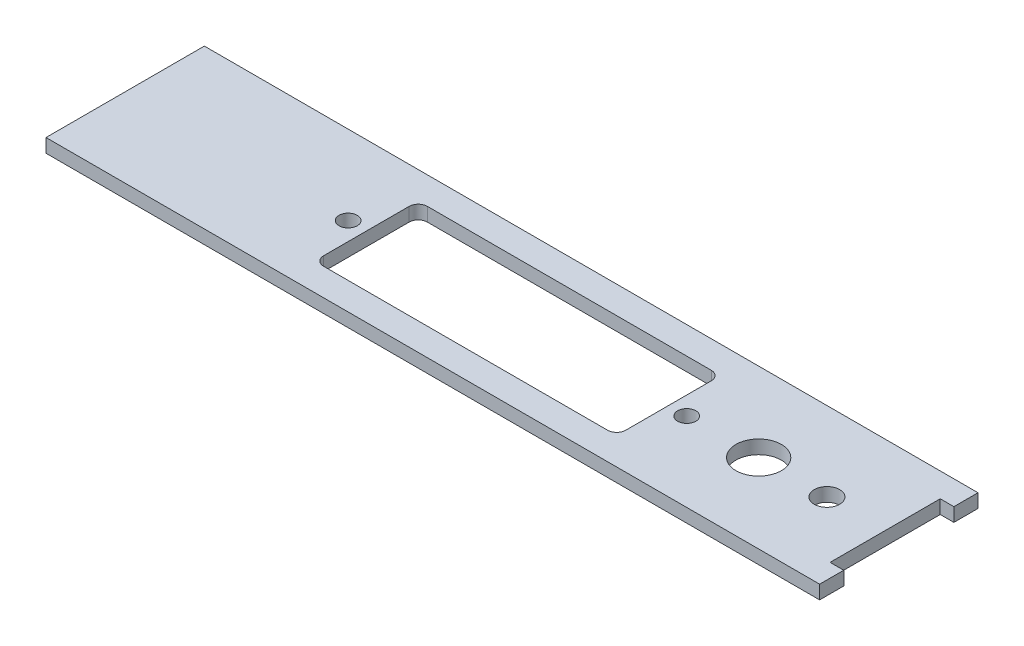
ISO-10303-21;
HEADER;
FILE_DESCRIPTION(('STEP AP214'),'2;1');
FILE_NAME('part.step','',(''),(''),'','','');
FILE_SCHEMA(('AUTOMOTIVE_DESIGN { 1 0 10303 214 1 1 1 1 }'));
ENDSEC;
DATA;
#1=APPLICATION_CONTEXT('core data for automotive mechanical design processes');
#2=APPLICATION_PROTOCOL_DEFINITION('international standard','automotive_design',2000,#1);
#3=PRODUCT_CONTEXT('',#1,'mechanical');
#4=PRODUCT('Part','Part','',(#3));
#5=PRODUCT_RELATED_PRODUCT_CATEGORY('part','',(#4));
#6=PRODUCT_DEFINITION_FORMATION('','',#4);
#7=PRODUCT_DEFINITION_CONTEXT('part definition',#1,'design');
#8=PRODUCT_DEFINITION('design','',#6,#7);
#9=PRODUCT_DEFINITION_SHAPE('','',#8);
#10=(LENGTH_UNIT() NAMED_UNIT(*) SI_UNIT(.MILLI.,.METRE.));
#11=(NAMED_UNIT(*) PLANE_ANGLE_UNIT() SI_UNIT($,.RADIAN.));
#12=(NAMED_UNIT(*) SI_UNIT($,.STERADIAN.) SOLID_ANGLE_UNIT());
#13=UNCERTAINTY_MEASURE_WITH_UNIT(LENGTH_MEASURE(1.E-05),#10,'distance_accuracy_value','');
#14=(GEOMETRIC_REPRESENTATION_CONTEXT(3) GLOBAL_UNCERTAINTY_ASSIGNED_CONTEXT((#13)) GLOBAL_UNIT_ASSIGNED_CONTEXT((#10,
#11,#12)) REPRESENTATION_CONTEXT('',''));
#15=CARTESIAN_POINT('',(0.,0.,0.));
#16=DIRECTION('',(0.,0.,1.));
#17=DIRECTION('',(1.,0.,0.));
#18=AXIS2_PLACEMENT_3D('',#15,#16,#17);
#19=CARTESIAN_POINT('',(0.,15.,0.));
#20=DIRECTION('',(0.,1.,0.));
#21=DIRECTION('',(0.,0.,1.));
#22=AXIS2_PLACEMENT_3D('',#19,#20,#21);
#23=PLANE('',#22);
#24=CARTESIAN_POINT('',(340.,15.,-4.16333634234434E-13));
#25=DIRECTION('',(0.,1.,0.));
#26=DIRECTION('',(0.,0.,1.));
#27=AXIS2_PLACEMENT_3D('',#24,#25,#26);
#28=CIRCLE('',#27,14.);
#29=CARTESIAN_POINT('',(340.,15.,13.9999999999996));
#30=VERTEX_POINT('',#29);
#31=EDGE_CURVE('E186',#30,#30,#28,.F.);
#32=ORIENTED_EDGE('',*,*,#31,.T.);
#33=EDGE_LOOP('',(#32));
#34=FACE_BOUND('',#33,.T.);
#35=CARTESIAN_POINT('',(186.,15.,0.));
#36=DIRECTION('',(0.,-1.,0.));
#37=DIRECTION('',(0.,0.,-1.));
#38=AXIS2_PLACEMENT_3D('',#35,#36,#37);
#39=CIRCLE('',#38,10.);
#40=CARTESIAN_POINT('',(186.,15.,-10.));
#41=VERTEX_POINT('',#40);
#42=EDGE_CURVE('E189',#41,#41,#39,.T.);
#43=ORIENTED_EDGE('',*,*,#42,.T.);
#44=EDGE_LOOP('',(#43));
#45=FACE_BOUND('',#44,.T.);
#46=CARTESIAN_POINT('',(-186.,15.,-4.16333634234434E-13));
#47=DIRECTION('',(0.,-1.,0.));
#48=DIRECTION('',(0.,0.,-1.));
#49=AXIS2_PLACEMENT_3D('',#46,#47,#48);
#50=CIRCLE('',#49,10.);
#51=CARTESIAN_POINT('',(-186.,15.,-10.0000000000004));
#52=VERTEX_POINT('',#51);
#53=EDGE_CURVE('E192',#52,#52,#50,.T.);
#54=ORIENTED_EDGE('',*,*,#53,.T.);
#55=EDGE_LOOP('',(#54));
#56=FACE_BOUND('',#55,.T.);
#57=CARTESIAN_POINT('',(156.,15.,47.));
#58=DIRECTION('',(0.,1.,0.));
#59=DIRECTION('',(0.,0.,1.));
#60=AXIS2_PLACEMENT_3D('',#57,#58,#59);
#61=CIRCLE('',#60,10.);
#62=CARTESIAN_POINT('',(166.,15.,47.));
#63=VERTEX_POINT('',#62);
#64=CARTESIAN_POINT('',(156.,15.,57.));
#65=VERTEX_POINT('',#64);
#66=EDGE_CURVE('E160',#63,#65,#61,.F.);
#67=ORIENTED_EDGE('',*,*,#66,.T.);
#68=DIRECTION('',(-1.,0.,0.));
#69=VECTOR('',#68,1.);
#70=CARTESIAN_POINT('',(166.,15.,57.));
#71=LINE('',#70,#69);
#72=CARTESIAN_POINT('',(-156.,15.,57.));
#73=VERTEX_POINT('',#72);
#74=EDGE_CURVE('E158',#73,#65,#71,.F.);
#75=ORIENTED_EDGE('',*,*,#74,.F.);
#76=CARTESIAN_POINT('',(-156.,15.,47.));
#77=DIRECTION('',(0.,1.,0.));
#78=DIRECTION('',(0.,0.,1.));
#79=AXIS2_PLACEMENT_3D('',#76,#77,#78);
#80=CIRCLE('',#79,10.);
#81=CARTESIAN_POINT('',(-166.,15.,47.));
#82=VERTEX_POINT('',#81);
#83=EDGE_CURVE('E157',#73,#82,#80,.F.);
#84=ORIENTED_EDGE('',*,*,#83,.T.);
#85=DIRECTION('',(0.,0.,-1.));
#86=VECTOR('',#85,1.);
#87=CARTESIAN_POINT('',(-166.,15.,57.));
#88=LINE('',#87,#86);
#89=CARTESIAN_POINT('',(-166.,15.,-47.));
#90=VERTEX_POINT('',#89);
#91=EDGE_CURVE('E154',#90,#82,#88,.F.);
#92=ORIENTED_EDGE('',*,*,#91,.F.);
#93=CARTESIAN_POINT('',(-156.,15.,-47.0000000000001));
#94=DIRECTION('',(0.,1.,0.));
#95=DIRECTION('',(0.,0.,1.));
#96=AXIS2_PLACEMENT_3D('',#93,#94,#95);
#97=CIRCLE('',#96,10.);
#98=CARTESIAN_POINT('',(-156.,15.,-57.));
#99=VERTEX_POINT('',#98);
#100=EDGE_CURVE('E151',#90,#99,#97,.F.);
#101=ORIENTED_EDGE('',*,*,#100,.T.);
#102=DIRECTION('',(1.,0.,0.));
#103=VECTOR('',#102,1.);
#104=CARTESIAN_POINT('',(-166.,15.,-57.));
#105=LINE('',#104,#103);
#106=CARTESIAN_POINT('',(156.,15.,-57.0000000000002));
#107=VERTEX_POINT('',#106);
#108=EDGE_CURVE('E148',#107,#99,#105,.F.);
#109=ORIENTED_EDGE('',*,*,#108,.F.);
#110=CARTESIAN_POINT('',(156.,15.,-47.0000000000002));
#111=DIRECTION('',(0.,1.,0.));
#112=DIRECTION('',(0.,0.,1.));
#113=AXIS2_PLACEMENT_3D('',#110,#111,#112);
#114=CIRCLE('',#113,10.);
#115=CARTESIAN_POINT('',(166.,15.,-47.0000000000002));
#116=VERTEX_POINT('',#115);
#117=EDGE_CURVE('E195',#107,#116,#114,.F.);
#118=ORIENTED_EDGE('',*,*,#117,.T.);
#119=DIRECTION('',(0.,0.,1.));
#120=VECTOR('',#119,1.);
#121=CARTESIAN_POINT('',(166.,15.,-57.0000000000002));
#122=LINE('',#121,#120);
#123=EDGE_CURVE('E85',#63,#116,#122,.F.);
#124=ORIENTED_EDGE('',*,*,#123,.F.);
#125=EDGE_LOOP('',(#67,#75,#84,#92,#101,#109,#118,#124));
#126=FACE_BOUND('',#125,.T.);
#127=CARTESIAN_POINT('',(265.,15.,0.));
#128=DIRECTION('',(0.,1.,0.));
#129=DIRECTION('',(0.,0.,1.));
#130=AXIS2_PLACEMENT_3D('',#127,#128,#129);
#131=CIRCLE('',#130,25.);
#132=CARTESIAN_POINT('',(265.,15.,25.));
#133=VERTEX_POINT('',#132);
#134=EDGE_CURVE('E19',#133,#133,#131,.F.);
#135=ORIENTED_EDGE('',*,*,#134,.T.);
#136=EDGE_LOOP('',(#135));
#137=FACE_BOUND('',#136,.T.);
#138=DIRECTION('',(-1.,0.,0.));
#139=VECTOR('',#138,1.);
#140=CARTESIAN_POINT('',(419.,15.,-87.));
#141=LINE('',#140,#139);
#142=CARTESIAN_POINT('',(-431.,15.,-87.0000000000004));
#143=VERTEX_POINT('',#142);
#144=CARTESIAN_POINT('',(419.,15.,-87.));
#145=VERTEX_POINT('',#144);
#146=EDGE_CURVE('E95',#143,#145,#141,.F.);
#147=ORIENTED_EDGE('',*,*,#146,.F.);
#148=DIRECTION('',(0.,0.,1.));
#149=VECTOR('',#148,1.);
#150=CARTESIAN_POINT('',(-431.,15.,-87.0000000000004));
#151=LINE('',#150,#149);
#152=CARTESIAN_POINT('',(-431.,15.,86.9999999999999));
#153=VERTEX_POINT('',#152);
#154=EDGE_CURVE('E135',#153,#143,#151,.F.);
#155=ORIENTED_EDGE('',*,*,#154,.F.);
#156=DIRECTION('',(1.,0.,0.));
#157=VECTOR('',#156,1.);
#158=CARTESIAN_POINT('',(-431.,15.,86.9999999999999));
#159=LINE('',#158,#157);
#160=CARTESIAN_POINT('',(419.,15.,87.));
#161=VERTEX_POINT('',#160);
#162=EDGE_CURVE('E126',#161,#153,#159,.F.);
#163=ORIENTED_EDGE('',*,*,#162,.F.);
#164=DIRECTION('',(0.,0.,-1.));
#165=VECTOR('',#164,1.);
#166=CARTESIAN_POINT('',(419.,15.,87.));
#167=LINE('',#166,#165);
#168=CARTESIAN_POINT('',(419.,15.,60.4999999999994));
#169=VERTEX_POINT('',#168);
#170=EDGE_CURVE('E120',#169,#161,#167,.F.);
#171=ORIENTED_EDGE('',*,*,#170,.F.);
#172=DIRECTION('',(-1.,0.,0.));
#173=VECTOR('',#172,1.);
#174=CARTESIAN_POINT('',(419.,15.,60.4999999999994));
#175=LINE('',#174,#173);
#176=CARTESIAN_POINT('',(404.,15.,60.5000000000001));
#177=VERTEX_POINT('',#176);
#178=EDGE_CURVE('E233',#177,#169,#175,.F.);
#179=ORIENTED_EDGE('',*,*,#178,.F.);
#180=DIRECTION('',(0.,0.,-1.));
#181=VECTOR('',#180,1.);
#182=CARTESIAN_POINT('',(404.,15.,60.5000000000001));
#183=LINE('',#182,#181);
#184=CARTESIAN_POINT('',(404.,15.,-60.5000000000002));
#185=VERTEX_POINT('',#184);
#186=EDGE_CURVE('E228',#185,#177,#183,.F.);
#187=ORIENTED_EDGE('',*,*,#186,.F.);
#188=DIRECTION('',(1.,0.,0.));
#189=VECTOR('',#188,1.);
#190=CARTESIAN_POINT('',(404.,15.,-60.5000000000002));
#191=LINE('',#190,#189);
#192=CARTESIAN_POINT('',(419.,15.,-60.5000000000002));
#193=VERTEX_POINT('',#192);
#194=EDGE_CURVE('E223',#193,#185,#191,.F.);
#195=ORIENTED_EDGE('',*,*,#194,.F.);
#196=DIRECTION('',(0.,0.,-1.));
#197=VECTOR('',#196,1.);
#198=CARTESIAN_POINT('',(419.,15.,-60.5000000000002));
#199=LINE('',#198,#197);
#200=EDGE_CURVE('E218',#145,#193,#199,.F.);
#201=ORIENTED_EDGE('',*,*,#200,.F.);
#202=EDGE_LOOP('',(#147,#155,#163,#171,#179,#187,#195,#201));
#203=FACE_BOUND('',#202,.T.);
#204=ADVANCED_FACE('F16',(#34,#45,#56,#126,#137,#203),#23,.T.);
#205=CARTESIAN_POINT('',(-431.,0.,-87.0000000000004));
#206=DIRECTION('',(-1.,0.,0.));
#207=DIRECTION('',(0.,0.,1.));
#208=AXIS2_PLACEMENT_3D('',#205,#206,#207);
#209=PLANE('',#208);
#210=DIRECTION('',(0.,1.,0.));
#211=VECTOR('',#210,1.);
#212=CARTESIAN_POINT('',(-431.,0.,-87.0000000000004));
#213=LINE('',#212,#211);
#214=CARTESIAN_POINT('',(-431.,0.,-87.0000000000004));
#215=VERTEX_POINT('',#214);
#216=EDGE_CURVE('E213',#215,#143,#213,.T.);
#217=ORIENTED_EDGE('',*,*,#216,.F.);
#218=DIRECTION('',(0.,0.,1.));
#219=VECTOR('',#218,1.);
#220=CARTESIAN_POINT('',(-431.,0.,-4.16333634234434E-13));
#221=LINE('',#220,#219);
#222=CARTESIAN_POINT('',(-431.,0.,86.9999999999999));
#223=VERTEX_POINT('',#222);
#224=EDGE_CURVE('E143',#215,#223,#221,.T.);
#225=ORIENTED_EDGE('',*,*,#224,.T.);
#226=DIRECTION('',(0.,1.,0.));
#227=VECTOR('',#226,1.);
#228=CARTESIAN_POINT('',(-431.,0.,86.9999999999999));
#229=LINE('',#228,#227);
#230=EDGE_CURVE('E131',#153,#223,#229,.F.);
#231=ORIENTED_EDGE('',*,*,#230,.F.);
#232=ORIENTED_EDGE('',*,*,#154,.T.);
#233=EDGE_LOOP('',(#217,#225,#231,#232));
#234=FACE_BOUND('',#233,.T.);
#235=ADVANCED_FACE('F141',(#234),#209,.T.);
#236=CARTESIAN_POINT('',(-431.,0.,86.9999999999999));
#237=DIRECTION('',(0.,0.,1.));
#238=DIRECTION('',(1.,0.,0.));
#239=AXIS2_PLACEMENT_3D('',#236,#237,#238);
#240=PLANE('',#239);
#241=ORIENTED_EDGE('',*,*,#230,.T.);
#242=DIRECTION('',(1.,0.,0.));
#243=VECTOR('',#242,1.);
#244=CARTESIAN_POINT('',(0.,0.,86.9999999999999));
#245=LINE('',#244,#243);
#246=CARTESIAN_POINT('',(419.,0.,87.));
#247=VERTEX_POINT('',#246);
#248=EDGE_CURVE('E245',#223,#247,#245,.T.);
#249=ORIENTED_EDGE('',*,*,#248,.T.);
#250=DIRECTION('',(0.,1.,0.));
#251=VECTOR('',#250,1.);
#252=CARTESIAN_POINT('',(419.,0.,87.));
#253=LINE('',#252,#251);
#254=EDGE_CURVE('E133',#161,#247,#253,.F.);
#255=ORIENTED_EDGE('',*,*,#254,.F.);
#256=ORIENTED_EDGE('',*,*,#162,.T.);
#257=EDGE_LOOP('',(#241,#249,#255,#256));
#258=FACE_BOUND('',#257,.T.);
#259=ADVANCED_FACE('F128',(#258),#240,.T.);
#260=CARTESIAN_POINT('',(419.,0.,87.));
#261=DIRECTION('',(1.,0.,0.));
#262=DIRECTION('',(0.,0.,-1.));
#263=AXIS2_PLACEMENT_3D('',#260,#261,#262);
#264=PLANE('',#263);
#265=ORIENTED_EDGE('',*,*,#254,.T.);
#266=DIRECTION('',(0.,0.,1.));
#267=VECTOR('',#266,1.);
#268=CARTESIAN_POINT('',(419.,0.,0.));
#269=LINE('',#268,#267);
#270=CARTESIAN_POINT('',(419.,0.,60.4999999999994));
#271=VERTEX_POINT('',#270);
#272=EDGE_CURVE('E239',#247,#271,#269,.F.);
#273=ORIENTED_EDGE('',*,*,#272,.T.);
#274=DIRECTION('',(0.,1.,0.));
#275=VECTOR('',#274,1.);
#276=CARTESIAN_POINT('',(419.,0.,60.4999999999994));
#277=LINE('',#276,#275);
#278=EDGE_CURVE('E230',#169,#271,#277,.F.);
#279=ORIENTED_EDGE('',*,*,#278,.F.);
#280=ORIENTED_EDGE('',*,*,#170,.T.);
#281=EDGE_LOOP('',(#265,#273,#279,#280));
#282=FACE_BOUND('',#281,.T.);
#283=ADVANCED_FACE('F237',(#282),#264,.T.);
#284=CARTESIAN_POINT('',(419.,0.,60.4999999999994));
#285=DIRECTION('',(0.,0.,-1.));
#286=DIRECTION('',(-1.,0.,0.));
#287=AXIS2_PLACEMENT_3D('',#284,#285,#286);
#288=PLANE('',#287);
#289=ORIENTED_EDGE('',*,*,#278,.T.);
#290=DIRECTION('',(1.,0.,0.));
#291=VECTOR('',#290,1.);
#292=CARTESIAN_POINT('',(0.,0.,60.4999999999999));
#293=LINE('',#292,#291);
#294=CARTESIAN_POINT('',(404.,0.,60.5000000000001));
#295=VERTEX_POINT('',#294);
#296=EDGE_CURVE('E248',#271,#295,#293,.F.);
#297=ORIENTED_EDGE('',*,*,#296,.T.);
#298=DIRECTION('',(0.,1.,0.));
#299=VECTOR('',#298,1.);
#300=CARTESIAN_POINT('',(404.,0.,60.5000000000001));
#301=LINE('',#300,#299);
#302=EDGE_CURVE('E225',#177,#295,#301,.F.);
#303=ORIENTED_EDGE('',*,*,#302,.F.);
#304=ORIENTED_EDGE('',*,*,#178,.T.);
#305=EDGE_LOOP('',(#289,#297,#303,#304));
#306=FACE_BOUND('',#305,.T.);
#307=ADVANCED_FACE('F350',(#306),#288,.T.);
#308=CARTESIAN_POINT('',(404.,0.,60.5000000000001));
#309=DIRECTION('',(1.,0.,0.));
#310=DIRECTION('',(0.,0.,-1.));
#311=AXIS2_PLACEMENT_3D('',#308,#309,#310);
#312=PLANE('',#311);
#313=ORIENTED_EDGE('',*,*,#302,.T.);
#314=DIRECTION('',(0.,0.,1.));
#315=VECTOR('',#314,1.);
#316=CARTESIAN_POINT('',(404.,0.,0.));
#317=LINE('',#316,#315);
#318=CARTESIAN_POINT('',(404.,0.,-60.5000000000002));
#319=VERTEX_POINT('',#318);
#320=EDGE_CURVE('E345',#295,#319,#317,.F.);
#321=ORIENTED_EDGE('',*,*,#320,.T.);
#322=DIRECTION('',(0.,1.,0.));
#323=VECTOR('',#322,1.);
#324=CARTESIAN_POINT('',(404.,0.,-60.5000000000002));
#325=LINE('',#324,#323);
#326=EDGE_CURVE('E220',#185,#319,#325,.F.);
#327=ORIENTED_EDGE('',*,*,#326,.F.);
#328=ORIENTED_EDGE('',*,*,#186,.T.);
#329=EDGE_LOOP('',(#313,#321,#327,#328));
#330=FACE_BOUND('',#329,.T.);
#331=ADVANCED_FACE('F371',(#330),#312,.T.);
#332=CARTESIAN_POINT('',(404.,0.,-60.5000000000002));
#333=DIRECTION('',(0.,0.,1.));
#334=DIRECTION('',(1.,0.,0.));
#335=AXIS2_PLACEMENT_3D('',#332,#333,#334);
#336=PLANE('',#335);
#337=ORIENTED_EDGE('',*,*,#326,.T.);
#338=DIRECTION('',(1.,0.,0.));
#339=VECTOR('',#338,1.);
#340=CARTESIAN_POINT('',(0.,0.,-60.5000000000001));
#341=LINE('',#340,#339);
#342=CARTESIAN_POINT('',(419.,0.,-60.5000000000002));
#343=VERTEX_POINT('',#342);
#344=EDGE_CURVE('E342',#319,#343,#341,.T.);
#345=ORIENTED_EDGE('',*,*,#344,.T.);
#346=DIRECTION('',(0.,1.,0.));
#347=VECTOR('',#346,1.);
#348=CARTESIAN_POINT('',(419.,0.,-60.5000000000002));
#349=LINE('',#348,#347);
#350=EDGE_CURVE('E215',#193,#343,#349,.F.);
#351=ORIENTED_EDGE('',*,*,#350,.F.);
#352=ORIENTED_EDGE('',*,*,#194,.T.);
#353=EDGE_LOOP('',(#337,#345,#351,#352));
#354=FACE_BOUND('',#353,.T.);
#355=ADVANCED_FACE('F368',(#354),#336,.T.);
#356=CARTESIAN_POINT('',(419.,0.,-60.5000000000002));
#357=DIRECTION('',(1.,0.,0.));
#358=DIRECTION('',(0.,0.,-1.));
#359=AXIS2_PLACEMENT_3D('',#356,#357,#358);
#360=PLANE('',#359);
#361=ORIENTED_EDGE('',*,*,#350,.T.);
#362=DIRECTION('',(0.,0.,1.));
#363=VECTOR('',#362,1.);
#364=CARTESIAN_POINT('',(419.,0.,0.));
#365=LINE('',#364,#363);
#366=CARTESIAN_POINT('',(419.,0.,-87.));
#367=VERTEX_POINT('',#366);
#368=EDGE_CURVE('E339',#343,#367,#365,.F.);
#369=ORIENTED_EDGE('',*,*,#368,.T.);
#370=DIRECTION('',(0.,1.,0.));
#371=VECTOR('',#370,1.);
#372=CARTESIAN_POINT('',(419.,0.,-87.));
#373=LINE('',#372,#371);
#374=EDGE_CURVE('E210',#145,#367,#373,.F.);
#375=ORIENTED_EDGE('',*,*,#374,.F.);
#376=ORIENTED_EDGE('',*,*,#200,.T.);
#377=EDGE_LOOP('',(#361,#369,#375,#376));
#378=FACE_BOUND('',#377,.T.);
#379=ADVANCED_FACE('F363',(#378),#360,.T.);
#380=CARTESIAN_POINT('',(419.,0.,-87.));
#381=DIRECTION('',(0.,0.,-1.));
#382=DIRECTION('',(-1.,0.,0.));
#383=AXIS2_PLACEMENT_3D('',#380,#381,#382);
#384=PLANE('',#383);
#385=ORIENTED_EDGE('',*,*,#374,.T.);
#386=DIRECTION('',(1.,0.,0.));
#387=VECTOR('',#386,1.);
#388=CARTESIAN_POINT('',(0.,0.,-87.));
#389=LINE('',#388,#387);
#390=EDGE_CURVE('E185',#367,#215,#389,.F.);
#391=ORIENTED_EDGE('',*,*,#390,.T.);
#392=ORIENTED_EDGE('',*,*,#216,.T.);
#393=ORIENTED_EDGE('',*,*,#146,.T.);
#394=EDGE_LOOP('',(#385,#391,#392,#393));
#395=FACE_BOUND('',#394,.T.);
#396=ADVANCED_FACE('F359',(#395),#384,.T.);
#397=CARTESIAN_POINT('',(265.,0.,0.));
#398=DIRECTION('',(0.,1.,0.));
#399=DIRECTION('',(0.,0.,1.));
#400=AXIS2_PLACEMENT_3D('',#397,#398,#399);
#401=CYLINDRICAL_SURFACE('',#400,25.);
#402=ORIENTED_EDGE('',*,*,#134,.F.);
#403=EDGE_LOOP('',(#402));
#404=FACE_BOUND('',#403,.T.);
#405=CARTESIAN_POINT('',(265.,0.,0.));
#406=DIRECTION('',(0.,1.,0.));
#407=DIRECTION('',(0.,0.,1.));
#408=AXIS2_PLACEMENT_3D('',#405,#406,#407);
#409=CIRCLE('',#408,25.);
#410=CARTESIAN_POINT('',(265.,0.,25.));
#411=VERTEX_POINT('',#410);
#412=EDGE_CURVE('E182',#411,#411,#409,.F.);
#413=ORIENTED_EDGE('',*,*,#412,.T.);
#414=EDGE_LOOP('',(#413));
#415=FACE_BOUND('',#414,.T.);
#416=ADVANCED_FACE('F285',(#404,#415),#401,.F.);
#417=CARTESIAN_POINT('',(166.,0.,-57.0000000000002));
#418=DIRECTION('',(-1.,0.,0.));
#419=DIRECTION('',(0.,0.,1.));
#420=AXIS2_PLACEMENT_3D('',#417,#418,#419);
#421=PLANE('',#420);
#422=DIRECTION('',(0.,0.,1.));
#423=VECTOR('',#422,1.);
#424=CARTESIAN_POINT('',(166.,0.,0.));
#425=LINE('',#424,#423);
#426=CARTESIAN_POINT('',(166.,0.,-47.0000000000002));
#427=VERTEX_POINT('',#426);
#428=CARTESIAN_POINT('',(166.,0.,47.));
#429=VERTEX_POINT('',#428);
#430=EDGE_CURVE('E181',#427,#429,#425,.T.);
#431=ORIENTED_EDGE('',*,*,#430,.T.);
#432=DIRECTION('',(0.,1.,0.));
#433=VECTOR('',#432,1.);
#434=CARTESIAN_POINT('',(166.,-1.16803736518,47.));
#435=LINE('',#434,#433);
#436=EDGE_CURVE('E153',#429,#63,#435,.T.);
#437=ORIENTED_EDGE('',*,*,#436,.T.);
#438=ORIENTED_EDGE('',*,*,#123,.T.);
#439=DIRECTION('',(0.,1.,0.));
#440=VECTOR('',#439,1.);
#441=CARTESIAN_POINT('',(166.,-1.16803736518,-47.0000000000002));
#442=LINE('',#441,#440);
#443=EDGE_CURVE('E254',#116,#427,#442,.F.);
#444=ORIENTED_EDGE('',*,*,#443,.T.);
#445=EDGE_LOOP('',(#431,#437,#438,#444));
#446=FACE_BOUND('',#445,.T.);
#447=ADVANCED_FACE('F276',(#446),#421,.T.);
#448=CARTESIAN_POINT('',(156.,-1.16803736518,47.));
#449=DIRECTION('',(0.,1.,0.));
#450=DIRECTION('',(0.,0.,1.));
#451=AXIS2_PLACEMENT_3D('',#448,#449,#450);
#452=CYLINDRICAL_SURFACE('',#451,10.);
#453=ORIENTED_EDGE('',*,*,#436,.F.);
#454=CARTESIAN_POINT('',(156.,0.,47.));
#455=DIRECTION('',(0.,1.,0.));
#456=DIRECTION('',(0.,0.,1.));
#457=AXIS2_PLACEMENT_3D('',#454,#455,#456);
#458=CIRCLE('',#457,10.);
#459=CARTESIAN_POINT('',(156.,0.,57.));
#460=VERTEX_POINT('',#459);
#461=EDGE_CURVE('E178',#429,#460,#458,.F.);
#462=ORIENTED_EDGE('',*,*,#461,.T.);
#463=DIRECTION('',(0.,1.,0.));
#464=VECTOR('',#463,1.);
#465=CARTESIAN_POINT('',(156.,0.,57.));
#466=LINE('',#465,#464);
#467=EDGE_CURVE('E159',#65,#460,#466,.F.);
#468=ORIENTED_EDGE('',*,*,#467,.F.);
#469=ORIENTED_EDGE('',*,*,#66,.F.);
#470=EDGE_LOOP('',(#453,#462,#468,#469));
#471=FACE_BOUND('',#470,.T.);
#472=ADVANCED_FACE('F274',(#471),#452,.F.);
#473=CARTESIAN_POINT('',(166.,0.,57.));
#474=DIRECTION('',(0.,0.,-1.));
#475=DIRECTION('',(-1.,0.,0.));
#476=AXIS2_PLACEMENT_3D('',#473,#474,#475);
#477=PLANE('',#476);
#478=DIRECTION('',(1.,0.,0.));
#479=VECTOR('',#478,1.);
#480=CARTESIAN_POINT('',(0.,0.,56.9999999999999));
#481=LINE('',#480,#479);
#482=CARTESIAN_POINT('',(-156.,0.,57.));
#483=VERTEX_POINT('',#482);
#484=EDGE_CURVE('E177',#460,#483,#481,.F.);
#485=ORIENTED_EDGE('',*,*,#484,.T.);
#486=DIRECTION('',(0.,1.,0.));
#487=VECTOR('',#486,1.);
#488=CARTESIAN_POINT('',(-156.,-1.16803736518,57.));
#489=LINE('',#488,#487);
#490=EDGE_CURVE('E201',#483,#73,#489,.T.);
#491=ORIENTED_EDGE('',*,*,#490,.T.);
#492=ORIENTED_EDGE('',*,*,#74,.T.);
#493=ORIENTED_EDGE('',*,*,#467,.T.);
#494=EDGE_LOOP('',(#485,#491,#492,#493));
#495=FACE_BOUND('',#494,.T.);
#496=ADVANCED_FACE('F265',(#495),#477,.T.);
#497=CARTESIAN_POINT('',(-156.,-1.16803736518,47.));
#498=DIRECTION('',(0.,1.,0.));
#499=DIRECTION('',(0.,0.,1.));
#500=AXIS2_PLACEMENT_3D('',#497,#498,#499);
#501=CYLINDRICAL_SURFACE('',#500,10.);
#502=ORIENTED_EDGE('',*,*,#490,.F.);
#503=CARTESIAN_POINT('',(-156.,0.,47.));
#504=DIRECTION('',(0.,1.,0.));
#505=DIRECTION('',(0.,0.,1.));
#506=AXIS2_PLACEMENT_3D('',#503,#504,#505);
#507=CIRCLE('',#506,10.);
#508=CARTESIAN_POINT('',(-166.,0.,47.));
#509=VERTEX_POINT('',#508);
#510=EDGE_CURVE('E174',#483,#509,#507,.F.);
#511=ORIENTED_EDGE('',*,*,#510,.T.);
#512=DIRECTION('',(0.,1.,0.));
#513=VECTOR('',#512,1.);
#514=CARTESIAN_POINT('',(-166.,0.,47.));
#515=LINE('',#514,#513);
#516=EDGE_CURVE('E156',#82,#509,#515,.F.);
#517=ORIENTED_EDGE('',*,*,#516,.F.);
#518=ORIENTED_EDGE('',*,*,#83,.F.);
#519=EDGE_LOOP('',(#502,#511,#517,#518));
#520=FACE_BOUND('',#519,.T.);
#521=ADVANCED_FACE('F283',(#520),#501,.F.);
#522=CARTESIAN_POINT('',(-166.,0.,57.));
#523=DIRECTION('',(1.,0.,0.));
#524=DIRECTION('',(0.,0.,-1.));
#525=AXIS2_PLACEMENT_3D('',#522,#523,#524);
#526=PLANE('',#525);
#527=ORIENTED_EDGE('',*,*,#91,.T.);
#528=ORIENTED_EDGE('',*,*,#516,.T.);
#529=DIRECTION('',(0.,0.,1.));
#530=VECTOR('',#529,1.);
#531=CARTESIAN_POINT('',(-166.,0.,-4.16333634234434E-13));
#532=LINE('',#531,#530);
#533=CARTESIAN_POINT('',(-166.,0.,-47.));
#534=VERTEX_POINT('',#533);
#535=EDGE_CURVE('E173',#509,#534,#532,.F.);
#536=ORIENTED_EDGE('',*,*,#535,.T.);
#537=DIRECTION('',(0.,1.,0.));
#538=VECTOR('',#537,1.);
#539=CARTESIAN_POINT('',(-166.,-1.16803736518,-47.));
#540=LINE('',#539,#538);
#541=EDGE_CURVE('E199',#534,#90,#540,.T.);
#542=ORIENTED_EDGE('',*,*,#541,.T.);
#543=EDGE_LOOP('',(#527,#528,#536,#542));
#544=FACE_BOUND('',#543,.T.);
#545=ADVANCED_FACE('F317',(#544),#526,.T.);
#546=CARTESIAN_POINT('',(-156.,-1.16803736518,-47.0000000000001));
#547=DIRECTION('',(0.,1.,0.));
#548=DIRECTION('',(0.,0.,1.));
#549=AXIS2_PLACEMENT_3D('',#546,#547,#548);
#550=CYLINDRICAL_SURFACE('',#549,10.);
#551=ORIENTED_EDGE('',*,*,#541,.F.);
#552=CARTESIAN_POINT('',(-156.,0.,-47.0000000000001));
#553=DIRECTION('',(0.,1.,0.));
#554=DIRECTION('',(0.,0.,1.));
#555=AXIS2_PLACEMENT_3D('',#552,#553,#554);
#556=CIRCLE('',#555,10.);
#557=CARTESIAN_POINT('',(-156.,0.,-57.));
#558=VERTEX_POINT('',#557);
#559=EDGE_CURVE('E170',#534,#558,#556,.F.);
#560=ORIENTED_EDGE('',*,*,#559,.T.);
#561=DIRECTION('',(0.,1.,0.));
#562=VECTOR('',#561,1.);
#563=CARTESIAN_POINT('',(-156.,0.,-57.));
#564=LINE('',#563,#562);
#565=EDGE_CURVE('E150',#99,#558,#564,.F.);
#566=ORIENTED_EDGE('',*,*,#565,.F.);
#567=ORIENTED_EDGE('',*,*,#100,.F.);
#568=EDGE_LOOP('',(#551,#560,#566,#567));
#569=FACE_BOUND('',#568,.T.);
#570=ADVANCED_FACE('F313',(#569),#550,.F.);
#571=CARTESIAN_POINT('',(-166.,0.,-57.));
#572=DIRECTION('',(0.,0.,1.));
#573=DIRECTION('',(1.,0.,0.));
#574=AXIS2_PLACEMENT_3D('',#571,#572,#573);
#575=PLANE('',#574);
#576=DIRECTION('',(1.,0.,0.));
#577=VECTOR('',#576,1.);
#578=CARTESIAN_POINT('',(0.,0.,-57.0000000000001));
#579=LINE('',#578,#577);
#580=CARTESIAN_POINT('',(156.,0.,-57.0000000000002));
#581=VERTEX_POINT('',#580);
#582=EDGE_CURVE('E169',#558,#581,#579,.T.);
#583=ORIENTED_EDGE('',*,*,#582,.T.);
#584=DIRECTION('',(0.,1.,0.));
#585=VECTOR('',#584,1.);
#586=CARTESIAN_POINT('',(156.,-1.16803736518,-57.0000000000002));
#587=LINE('',#586,#585);
#588=EDGE_CURVE('E34',#581,#107,#587,.T.);
#589=ORIENTED_EDGE('',*,*,#588,.T.);
#590=ORIENTED_EDGE('',*,*,#108,.T.);
#591=ORIENTED_EDGE('',*,*,#565,.T.);
#592=EDGE_LOOP('',(#583,#589,#590,#591));
#593=FACE_BOUND('',#592,.T.);
#594=ADVANCED_FACE('F310',(#593),#575,.T.);
#595=CARTESIAN_POINT('',(156.,-1.16803736518,-47.0000000000002));
#596=DIRECTION('',(0.,1.,0.));
#597=DIRECTION('',(0.,0.,1.));
#598=AXIS2_PLACEMENT_3D('',#595,#596,#597);
#599=CYLINDRICAL_SURFACE('',#598,10.);
#600=ORIENTED_EDGE('',*,*,#588,.F.);
#601=CARTESIAN_POINT('',(156.,0.,-47.0000000000002));
#602=DIRECTION('',(0.,1.,0.));
#603=DIRECTION('',(0.,0.,1.));
#604=AXIS2_PLACEMENT_3D('',#601,#602,#603);
#605=CIRCLE('',#604,10.);
#606=EDGE_CURVE('E167',#581,#427,#605,.F.);
#607=ORIENTED_EDGE('',*,*,#606,.T.);
#608=ORIENTED_EDGE('',*,*,#443,.F.);
#609=ORIENTED_EDGE('',*,*,#117,.F.);
#610=EDGE_LOOP('',(#600,#607,#608,#609));
#611=FACE_BOUND('',#610,.T.);
#612=ADVANCED_FACE('F306',(#611),#599,.F.);
#613=CARTESIAN_POINT('',(-186.,15.,-4.16333634234434E-13));
#614=DIRECTION('',(0.,-1.,0.));
#615=DIRECTION('',(0.,0.,-1.));
#616=AXIS2_PLACEMENT_3D('',#613,#614,#615);
#617=CYLINDRICAL_SURFACE('',#616,10.);
#618=ORIENTED_EDGE('',*,*,#53,.F.);
#619=EDGE_LOOP('',(#618));
#620=FACE_BOUND('',#619,.T.);
#621=CARTESIAN_POINT('',(-186.,0.,-4.16333634234434E-13));
#622=DIRECTION('',(0.,-1.,0.));
#623=DIRECTION('',(0.,0.,-1.));
#624=AXIS2_PLACEMENT_3D('',#621,#622,#623);
#625=CIRCLE('',#624,10.);
#626=CARTESIAN_POINT('',(-186.,0.,-10.0000000000004));
#627=VERTEX_POINT('',#626);
#628=EDGE_CURVE('E164',#627,#627,#625,.T.);
#629=ORIENTED_EDGE('',*,*,#628,.T.);
#630=EDGE_LOOP('',(#629));
#631=FACE_BOUND('',#630,.T.);
#632=ADVANCED_FACE('F302',(#620,#631),#617,.F.);
#633=CARTESIAN_POINT('',(186.,15.,0.));
#634=DIRECTION('',(0.,-1.,0.));
#635=DIRECTION('',(0.,0.,-1.));
#636=AXIS2_PLACEMENT_3D('',#633,#634,#635);
#637=CYLINDRICAL_SURFACE('',#636,10.);
#638=ORIENTED_EDGE('',*,*,#42,.F.);
#639=EDGE_LOOP('',(#638));
#640=FACE_BOUND('',#639,.T.);
#641=CARTESIAN_POINT('',(186.,0.,0.));
#642=DIRECTION('',(0.,-1.,0.));
#643=DIRECTION('',(0.,0.,-1.));
#644=AXIS2_PLACEMENT_3D('',#641,#642,#643);
#645=CIRCLE('',#644,10.);
#646=CARTESIAN_POINT('',(186.,0.,-10.));
#647=VERTEX_POINT('',#646);
#648=EDGE_CURVE('E25',#647,#647,#645,.T.);
#649=ORIENTED_EDGE('',*,*,#648,.T.);
#650=EDGE_LOOP('',(#649));
#651=FACE_BOUND('',#650,.T.);
#652=ADVANCED_FACE('F294',(#640,#651),#637,.F.);
#653=CARTESIAN_POINT('',(340.,-71.0063121584,-4.16333634234434E-13));
#654=DIRECTION('',(0.,1.,0.));
#655=DIRECTION('',(0.,0.,1.));
#656=AXIS2_PLACEMENT_3D('',#653,#654,#655);
#657=CYLINDRICAL_SURFACE('',#656,14.);
#658=ORIENTED_EDGE('',*,*,#31,.F.);
#659=EDGE_LOOP('',(#658));
#660=FACE_BOUND('',#659,.T.);
#661=CARTESIAN_POINT('',(340.,0.,-4.16333634234434E-13));
#662=DIRECTION('',(0.,1.,0.));
#663=DIRECTION('',(0.,0.,1.));
#664=AXIS2_PLACEMENT_3D('',#661,#662,#663);
#665=CIRCLE('',#664,14.);
#666=CARTESIAN_POINT('',(340.,0.,13.9999999999996));
#667=VERTEX_POINT('',#666);
#668=EDGE_CURVE('E11',#667,#667,#665,.F.);
#669=ORIENTED_EDGE('',*,*,#668,.T.);
#670=EDGE_LOOP('',(#669));
#671=FACE_BOUND('',#670,.T.);
#672=ADVANCED_FACE('F288',(#660,#671),#657,.F.);
#673=CARTESIAN_POINT('',(0.,0.,0.));
#674=DIRECTION('',(0.,1.,0.));
#675=DIRECTION('',(0.,0.,1.));
#676=AXIS2_PLACEMENT_3D('',#673,#674,#675);
#677=PLANE('',#676);
#678=ORIENTED_EDGE('',*,*,#668,.F.);
#679=EDGE_LOOP('',(#678));
#680=FACE_BOUND('',#679,.T.);
#681=ORIENTED_EDGE('',*,*,#648,.F.);
#682=EDGE_LOOP('',(#681));
#683=FACE_BOUND('',#682,.T.);
#684=ORIENTED_EDGE('',*,*,#628,.F.);
#685=EDGE_LOOP('',(#684));
#686=FACE_BOUND('',#685,.T.);
#687=ORIENTED_EDGE('',*,*,#582,.F.);
#688=ORIENTED_EDGE('',*,*,#559,.F.);
#689=ORIENTED_EDGE('',*,*,#535,.F.);
#690=ORIENTED_EDGE('',*,*,#510,.F.);
#691=ORIENTED_EDGE('',*,*,#484,.F.);
#692=ORIENTED_EDGE('',*,*,#461,.F.);
#693=ORIENTED_EDGE('',*,*,#430,.F.);
#694=ORIENTED_EDGE('',*,*,#606,.F.);
#695=EDGE_LOOP('',(#687,#688,#689,#690,#691,#692,#693,#694));
#696=FACE_BOUND('',#695,.T.);
#697=ORIENTED_EDGE('',*,*,#412,.F.);
#698=EDGE_LOOP('',(#697));
#699=FACE_BOUND('',#698,.T.);
#700=ORIENTED_EDGE('',*,*,#368,.F.);
#701=ORIENTED_EDGE('',*,*,#344,.F.);
#702=ORIENTED_EDGE('',*,*,#320,.F.);
#703=ORIENTED_EDGE('',*,*,#296,.F.);
#704=ORIENTED_EDGE('',*,*,#272,.F.);
#705=ORIENTED_EDGE('',*,*,#248,.F.);
#706=ORIENTED_EDGE('',*,*,#224,.F.);
#707=ORIENTED_EDGE('',*,*,#390,.F.);
#708=EDGE_LOOP('',(#700,#701,#702,#703,#704,#705,#706,#707));
#709=FACE_BOUND('',#708,.T.);
#710=ADVANCED_FACE('F244',(#680,#683,#686,#696,#699,#709),#677,.F.);
#711=CLOSED_SHELL('',(#204,#235,#259,#283,#307,#331,#355,#379,#396,#416,#447,#472,#496,#521,
#545,#570,#594,#612,#632,#652,#672,#710));
#712=MANIFOLD_SOLID_BREP('B1',#711);
#713=ADVANCED_BREP_SHAPE_REPRESENTATION('',(#18,#712),#14);
#714=SHAPE_DEFINITION_REPRESENTATION(#9,#713);
ENDSEC;
END-ISO-10303-21;
